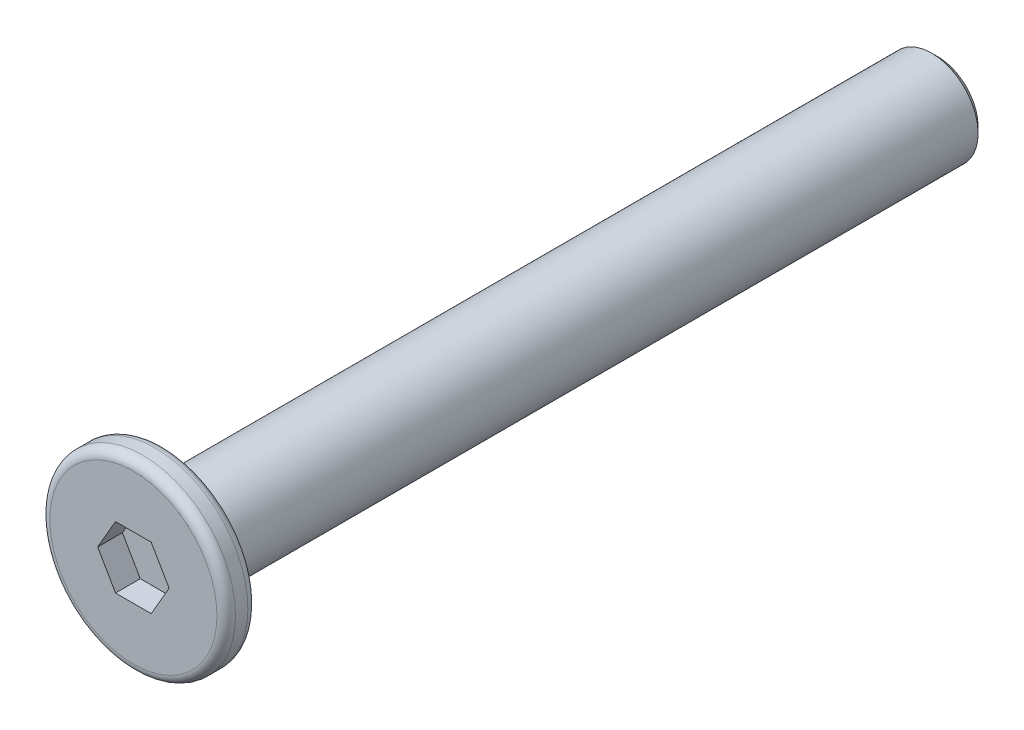
ISO-10303-21;
HEADER;
FILE_DESCRIPTION(('STEP AP214'),'2;1');
FILE_NAME('part.step','',(''),(''),'','','');
FILE_SCHEMA(('AUTOMOTIVE_DESIGN { 1 0 10303 214 1 1 1 1 }'));
ENDSEC;
DATA;
#1=APPLICATION_CONTEXT('core data for automotive mechanical design processes');
#2=APPLICATION_PROTOCOL_DEFINITION('international standard','automotive_design',2000,#1);
#3=PRODUCT_CONTEXT('',#1,'mechanical');
#4=PRODUCT('Part','Part','',(#3));
#5=PRODUCT_RELATED_PRODUCT_CATEGORY('part','',(#4));
#6=PRODUCT_DEFINITION_FORMATION('','',#4);
#7=PRODUCT_DEFINITION_CONTEXT('part definition',#1,'design');
#8=PRODUCT_DEFINITION('design','',#6,#7);
#9=PRODUCT_DEFINITION_SHAPE('','',#8);
#10=(LENGTH_UNIT() NAMED_UNIT(*) SI_UNIT(.MILLI.,.METRE.));
#11=(NAMED_UNIT(*) PLANE_ANGLE_UNIT() SI_UNIT($,.RADIAN.));
#12=(NAMED_UNIT(*) SI_UNIT($,.STERADIAN.) SOLID_ANGLE_UNIT());
#13=UNCERTAINTY_MEASURE_WITH_UNIT(LENGTH_MEASURE(1.E-05),#10,'distance_accuracy_value','');
#14=(GEOMETRIC_REPRESENTATION_CONTEXT(3) GLOBAL_UNCERTAINTY_ASSIGNED_CONTEXT((#13)) GLOBAL_UNIT_ASSIGNED_CONTEXT((#10,
#11,#12)) REPRESENTATION_CONTEXT('',''));
#15=CARTESIAN_POINT('',(0.,0.,0.));
#16=DIRECTION('',(0.,0.,1.));
#17=DIRECTION('',(1.,0.,0.));
#18=AXIS2_PLACEMENT_3D('',#15,#16,#17);
#19=CARTESIAN_POINT('',(0.,0.,0.5));
#20=DIRECTION('',(0.,0.,-1.));
#21=DIRECTION('',(-1.,0.,0.));
#22=AXIS2_PLACEMENT_3D('',#19,#20,#21);
#23=CYLINDRICAL_SURFACE('',#22,3.);
#24=CARTESIAN_POINT('',(0.,0.,-0.2));
#25=DIRECTION('',(0.,0.,1.));
#26=DIRECTION('',(1.,0.,0.));
#27=AXIS2_PLACEMENT_3D('',#24,#25,#26);
#28=CIRCLE('',#27,3.);
#29=CARTESIAN_POINT('',(3.,0.,-0.2));
#30=VERTEX_POINT('',#29);
#31=EDGE_CURVE('E154',#30,#30,#28,.T.);
#32=ORIENTED_EDGE('',*,*,#31,.T.);
#33=EDGE_LOOP('',(#32));
#34=FACE_BOUND('',#33,.T.);
#35=CARTESIAN_POINT('',(0.,0.,0.2));
#36=DIRECTION('',(0.,0.,1.));
#37=DIRECTION('',(1.,0.,0.));
#38=AXIS2_PLACEMENT_3D('',#35,#36,#37);
#39=CIRCLE('',#38,3.);
#40=CARTESIAN_POINT('',(3.,0.,0.2));
#41=VERTEX_POINT('',#40);
#42=EDGE_CURVE('E151',#41,#41,#39,.F.);
#43=ORIENTED_EDGE('',*,*,#42,.T.);
#44=EDGE_LOOP('',(#43));
#45=FACE_BOUND('',#44,.T.);
#46=ADVANCED_FACE('F35',(#34,#45),#23,.T.);
#47=CARTESIAN_POINT('',(0.,0.,0.5));
#48=DIRECTION('',(0.,0.,1.));
#49=DIRECTION('',(1.,0.,0.));
#50=AXIS2_PLACEMENT_3D('',#47,#48,#49);
#51=PLANE('',#50);
#52=CARTESIAN_POINT('',(0.,0.,0.5));
#53=DIRECTION('',(0.,0.,1.));
#54=DIRECTION('',(1.,0.,0.));
#55=AXIS2_PLACEMENT_3D('',#52,#53,#54);
#56=CIRCLE('',#55,2.7);
#57=CARTESIAN_POINT('',(2.7,0.,0.5));
#58=VERTEX_POINT('',#57);
#59=EDGE_CURVE('E11',#58,#58,#56,.T.);
#60=ORIENTED_EDGE('',*,*,#59,.T.);
#61=EDGE_LOOP('',(#60));
#62=FACE_BOUND('',#61,.T.);
#63=DIRECTION('',(0.5,0.866025403784439,0.));
#64=VECTOR('',#63,1.);
#65=CARTESIAN_POINT('',(0.577350269189626,-1.,0.5));
#66=LINE('',#65,#64);
#67=CARTESIAN_POINT('',(0.577350269189626,-1.,0.5));
#68=VERTEX_POINT('',#67);
#69=CARTESIAN_POINT('',(1.15470053837925,0.,0.5));
#70=VERTEX_POINT('',#69);
#71=EDGE_CURVE('E50',#68,#70,#66,.T.);
#72=ORIENTED_EDGE('',*,*,#71,.F.);
#73=DIRECTION('',(1.,0.,0.));
#74=VECTOR('',#73,1.);
#75=CARTESIAN_POINT('',(-0.577350269189625,-1.,0.5));
#76=LINE('',#75,#74);
#77=CARTESIAN_POINT('',(-0.577350269189625,-1.,0.5));
#78=VERTEX_POINT('',#77);
#79=EDGE_CURVE('E133',#78,#68,#76,.T.);
#80=ORIENTED_EDGE('',*,*,#79,.F.);
#81=DIRECTION('',(0.5,-0.866025403784438,0.));
#82=VECTOR('',#81,1.);
#83=CARTESIAN_POINT('',(-1.15470053837925,0.,0.5));
#84=LINE('',#83,#82);
#85=CARTESIAN_POINT('',(-1.15470053837925,0.,0.5));
#86=VERTEX_POINT('',#85);
#87=EDGE_CURVE('E131',#86,#78,#84,.T.);
#88=ORIENTED_EDGE('',*,*,#87,.F.);
#89=DIRECTION('',(-0.5,-0.866025403784438,0.));
#90=VECTOR('',#89,1.);
#91=CARTESIAN_POINT('',(-0.577350269189626,1.,0.5));
#92=LINE('',#91,#90);
#93=CARTESIAN_POINT('',(-0.577350269189626,1.,0.5));
#94=VERTEX_POINT('',#93);
#95=EDGE_CURVE('E98',#94,#86,#92,.T.);
#96=ORIENTED_EDGE('',*,*,#95,.F.);
#97=DIRECTION('',(-1.,0.,0.));
#98=VECTOR('',#97,1.);
#99=CARTESIAN_POINT('',(0.577350269189625,1.,0.5));
#100=LINE('',#99,#98);
#101=CARTESIAN_POINT('',(0.577350269189625,1.,0.5));
#102=VERTEX_POINT('',#101);
#103=EDGE_CURVE('E127',#102,#94,#100,.T.);
#104=ORIENTED_EDGE('',*,*,#103,.F.);
#105=DIRECTION('',(-0.5,0.866025403784438,0.));
#106=VECTOR('',#105,1.);
#107=CARTESIAN_POINT('',(1.15470053837925,0.,0.5));
#108=LINE('',#107,#106);
#109=EDGE_CURVE('E124',#70,#102,#108,.T.);
#110=ORIENTED_EDGE('',*,*,#109,.F.);
#111=EDGE_LOOP('',(#72,#80,#88,#96,#104,#110));
#112=FACE_BOUND('',#111,.T.);
#113=ADVANCED_FACE('F169',(#62,#112),#51,.T.);
#114=CARTESIAN_POINT('',(0.,0.,-0.5));
#115=DIRECTION('',(0.,0.,1.));
#116=DIRECTION('',(1.,0.,0.));
#117=AXIS2_PLACEMENT_3D('',#114,#115,#116);
#118=PLANE('',#117);
#119=CARTESIAN_POINT('',(0.,0.,-0.5));
#120=DIRECTION('',(0.,0.,1.));
#121=DIRECTION('',(1.,0.,0.));
#122=AXIS2_PLACEMENT_3D('',#119,#120,#121);
#123=CIRCLE('',#122,2.7);
#124=CARTESIAN_POINT('',(2.7,0.,-0.5));
#125=VERTEX_POINT('',#124);
#126=EDGE_CURVE('E43',#125,#125,#123,.F.);
#127=ORIENTED_EDGE('',*,*,#126,.T.);
#128=EDGE_LOOP('',(#127));
#129=FACE_BOUND('',#128,.T.);
#130=CARTESIAN_POINT('',(0.,0.,-0.5));
#131=DIRECTION('',(0.,0.,-1.));
#132=DIRECTION('',(-1.,0.,0.));
#133=AXIS2_PLACEMENT_3D('',#130,#131,#132);
#134=CIRCLE('',#133,1.5);
#135=CARTESIAN_POINT('',(-1.5,0.,-0.5));
#136=VERTEX_POINT('',#135);
#137=EDGE_CURVE('E137',#136,#136,#134,.T.);
#138=ORIENTED_EDGE('',*,*,#137,.F.);
#139=EDGE_LOOP('',(#138));
#140=FACE_BOUND('',#139,.T.);
#141=ADVANCED_FACE('F159',(#129,#140),#118,.F.);
#142=CARTESIAN_POINT('',(0.,0.,-25.5));
#143=DIRECTION('',(0.,0.,1.));
#144=DIRECTION('',(1.,0.,0.));
#145=AXIS2_PLACEMENT_3D('',#142,#143,#144);
#146=CYLINDRICAL_SURFACE('',#145,1.5);
#147=CARTESIAN_POINT('',(0.,0.,-25.3));
#148=DIRECTION('',(0.,0.,-1.));
#149=DIRECTION('',(-1.,0.,0.));
#150=AXIS2_PLACEMENT_3D('',#147,#148,#149);
#151=CIRCLE('',#150,1.5);
#152=CARTESIAN_POINT('',(-1.5,0.,-25.3));
#153=VERTEX_POINT('',#152);
#154=EDGE_CURVE('E148',#153,#153,#151,.F.);
#155=ORIENTED_EDGE('',*,*,#154,.T.);
#156=EDGE_LOOP('',(#155));
#157=FACE_BOUND('',#156,.T.);
#158=ORIENTED_EDGE('',*,*,#137,.T.);
#159=EDGE_LOOP('',(#158));
#160=FACE_BOUND('',#159,.T.);
#161=ADVANCED_FACE('F204',(#157,#160),#146,.T.);
#162=CARTESIAN_POINT('',(0.,0.,-25.5));
#163=DIRECTION('',(0.,0.,-1.));
#164=DIRECTION('',(-1.,0.,0.));
#165=AXIS2_PLACEMENT_3D('',#162,#163,#164);
#166=PLANE('',#165);
#167=CARTESIAN_POINT('',(0.,0.,-25.5));
#168=DIRECTION('',(0.,0.,-1.));
#169=DIRECTION('',(-1.,0.,0.));
#170=AXIS2_PLACEMENT_3D('',#167,#168,#169);
#171=CIRCLE('',#170,1.3);
#172=CARTESIAN_POINT('',(-1.3,0.,-25.5));
#173=VERTEX_POINT('',#172);
#174=EDGE_CURVE('E145',#173,#173,#171,.T.);
#175=ORIENTED_EDGE('',*,*,#174,.T.);
#176=EDGE_LOOP('',(#175));
#177=FACE_BOUND('',#176,.T.);
#178=ADVANCED_FACE('F196',(#177),#166,.T.);
#179=CARTESIAN_POINT('',(0.,0.,-25.5));
#180=DIRECTION('',(0.,0.,1.));
#181=DIRECTION('',(1.,0.,0.));
#182=AXIS2_PLACEMENT_3D('',#179,#180,#181);
#183=CONICAL_SURFACE('',#182,1.3,0.785398163397446);
#184=ORIENTED_EDGE('',*,*,#154,.F.);
#185=EDGE_LOOP('',(#184));
#186=FACE_BOUND('',#185,.T.);
#187=ORIENTED_EDGE('',*,*,#174,.F.);
#188=EDGE_LOOP('',(#187));
#189=FACE_BOUND('',#188,.T.);
#190=ADVANCED_FACE('F189',(#186,#189),#183,.T.);
#191=CARTESIAN_POINT('',(0.577350269189626,-1.,-0.3));
#192=DIRECTION('',(0.866025403784439,-0.5,0.));
#193=DIRECTION('',(0.5,0.866025403784439,0.));
#194=AXIS2_PLACEMENT_3D('',#191,#192,#193);
#195=PLANE('',#194);
#196=ORIENTED_EDGE('',*,*,#71,.T.);
#197=DIRECTION('',(0.,0.,1.));
#198=VECTOR('',#197,1.);
#199=CARTESIAN_POINT('',(1.15470053837925,0.,-0.3));
#200=LINE('',#199,#198);
#201=CARTESIAN_POINT('',(1.15470053837925,0.,-0.3));
#202=VERTEX_POINT('',#201);
#203=EDGE_CURVE('E80',#202,#70,#200,.T.);
#204=ORIENTED_EDGE('',*,*,#203,.F.);
#205=DIRECTION('',(0.5,0.866025403784439,0.));
#206=VECTOR('',#205,1.);
#207=CARTESIAN_POINT('',(0.577350269189626,-1.,-0.3));
#208=LINE('',#207,#206);
#209=CARTESIAN_POINT('',(0.577350269189626,-1.,-0.3));
#210=VERTEX_POINT('',#209);
#211=EDGE_CURVE('E135',#210,#202,#208,.T.);
#212=ORIENTED_EDGE('',*,*,#211,.F.);
#213=DIRECTION('',(0.,0.,1.));
#214=VECTOR('',#213,1.);
#215=CARTESIAN_POINT('',(0.577350269189626,-1.,-0.3));
#216=LINE('',#215,#214);
#217=EDGE_CURVE('E58',#210,#68,#216,.T.);
#218=ORIENTED_EDGE('',*,*,#217,.T.);
#219=EDGE_LOOP('',(#196,#204,#212,#218));
#220=FACE_BOUND('',#219,.T.);
#221=ADVANCED_FACE('F186',(#220),#195,.F.);
#222=CARTESIAN_POINT('',(-0.577350269189625,-1.,-0.3));
#223=DIRECTION('',(0.,-1.,0.));
#224=DIRECTION('',(1.,0.,0.));
#225=AXIS2_PLACEMENT_3D('',#222,#223,#224);
#226=PLANE('',#225);
#227=ORIENTED_EDGE('',*,*,#79,.T.);
#228=ORIENTED_EDGE('',*,*,#217,.F.);
#229=DIRECTION('',(1.,0.,0.));
#230=VECTOR('',#229,1.);
#231=CARTESIAN_POINT('',(-0.577350269189625,-1.,-0.3));
#232=LINE('',#231,#230);
#233=CARTESIAN_POINT('',(-0.577350269189625,-1.,-0.3));
#234=VERTEX_POINT('',#233);
#235=EDGE_CURVE('E110',#234,#210,#232,.T.);
#236=ORIENTED_EDGE('',*,*,#235,.F.);
#237=DIRECTION('',(0.,0.,1.));
#238=VECTOR('',#237,1.);
#239=CARTESIAN_POINT('',(-0.577350269189625,-1.,-0.3));
#240=LINE('',#239,#238);
#241=EDGE_CURVE('E102',#234,#78,#240,.T.);
#242=ORIENTED_EDGE('',*,*,#241,.T.);
#243=EDGE_LOOP('',(#227,#228,#236,#242));
#244=FACE_BOUND('',#243,.T.);
#245=ADVANCED_FACE('F188',(#244),#226,.F.);
#246=CARTESIAN_POINT('',(-1.15470053837925,0.,-0.3));
#247=DIRECTION('',(-0.866025403784438,-0.5,0.));
#248=DIRECTION('',(0.5,-0.866025403784438,0.));
#249=AXIS2_PLACEMENT_3D('',#246,#247,#248);
#250=PLANE('',#249);
#251=ORIENTED_EDGE('',*,*,#87,.T.);
#252=ORIENTED_EDGE('',*,*,#241,.F.);
#253=DIRECTION('',(0.5,-0.866025403784438,0.));
#254=VECTOR('',#253,1.);
#255=CARTESIAN_POINT('',(-1.15470053837925,0.,-0.3));
#256=LINE('',#255,#254);
#257=CARTESIAN_POINT('',(-1.15470053837925,0.,-0.3));
#258=VERTEX_POINT('',#257);
#259=EDGE_CURVE('E106',#258,#234,#256,.T.);
#260=ORIENTED_EDGE('',*,*,#259,.F.);
#261=DIRECTION('',(0.,0.,1.));
#262=VECTOR('',#261,1.);
#263=CARTESIAN_POINT('',(-1.15470053837925,0.,-0.3));
#264=LINE('',#263,#262);
#265=EDGE_CURVE('E91',#258,#86,#264,.T.);
#266=ORIENTED_EDGE('',*,*,#265,.T.);
#267=EDGE_LOOP('',(#251,#252,#260,#266));
#268=FACE_BOUND('',#267,.T.);
#269=ADVANCED_FACE('F107',(#268),#250,.F.);
#270=CARTESIAN_POINT('',(-0.577350269189626,1.,-0.3));
#271=DIRECTION('',(-0.866025403784438,0.5,0.));
#272=DIRECTION('',(-0.5,-0.866025403784439,0.));
#273=AXIS2_PLACEMENT_3D('',#270,#271,#272);
#274=PLANE('',#273);
#275=ORIENTED_EDGE('',*,*,#95,.T.);
#276=ORIENTED_EDGE('',*,*,#265,.F.);
#277=DIRECTION('',(-0.5,-0.866025403784438,0.));
#278=VECTOR('',#277,1.);
#279=CARTESIAN_POINT('',(-0.577350269189626,1.,-0.3));
#280=LINE('',#279,#278);
#281=CARTESIAN_POINT('',(-0.577350269189626,1.,-0.3));
#282=VERTEX_POINT('',#281);
#283=EDGE_CURVE('E95',#282,#258,#280,.T.);
#284=ORIENTED_EDGE('',*,*,#283,.F.);
#285=DIRECTION('',(0.,0.,1.));
#286=VECTOR('',#285,1.);
#287=CARTESIAN_POINT('',(-0.577350269189626,1.,-0.3));
#288=LINE('',#287,#286);
#289=EDGE_CURVE('E103',#282,#94,#288,.T.);
#290=ORIENTED_EDGE('',*,*,#289,.T.);
#291=EDGE_LOOP('',(#275,#276,#284,#290));
#292=FACE_BOUND('',#291,.T.);
#293=ADVANCED_FACE('F93',(#292),#274,.F.);
#294=CARTESIAN_POINT('',(0.577350269189625,1.,-0.3));
#295=DIRECTION('',(0.,1.,0.));
#296=DIRECTION('',(0.,0.,1.));
#297=AXIS2_PLACEMENT_3D('',#294,#295,#296);
#298=PLANE('',#297);
#299=ORIENTED_EDGE('',*,*,#103,.T.);
#300=ORIENTED_EDGE('',*,*,#289,.F.);
#301=DIRECTION('',(-1.,0.,0.));
#302=VECTOR('',#301,1.);
#303=CARTESIAN_POINT('',(0.577350269189625,1.,-0.3));
#304=LINE('',#303,#302);
#305=CARTESIAN_POINT('',(0.577350269189625,1.,-0.3));
#306=VERTEX_POINT('',#305);
#307=EDGE_CURVE('E116',#306,#282,#304,.T.);
#308=ORIENTED_EDGE('',*,*,#307,.F.);
#309=DIRECTION('',(0.,0.,1.));
#310=VECTOR('',#309,1.);
#311=CARTESIAN_POINT('',(0.577350269189625,1.,-0.3));
#312=LINE('',#311,#310);
#313=EDGE_CURVE('E140',#306,#102,#312,.T.);
#314=ORIENTED_EDGE('',*,*,#313,.T.);
#315=EDGE_LOOP('',(#299,#300,#308,#314));
#316=FACE_BOUND('',#315,.T.);
#317=ADVANCED_FACE('F257',(#316),#298,.F.);
#318=CARTESIAN_POINT('',(1.15470053837925,0.,-0.3));
#319=DIRECTION('',(0.866025403784438,0.5,0.));
#320=DIRECTION('',(-0.5,0.866025403784439,0.));
#321=AXIS2_PLACEMENT_3D('',#318,#319,#320);
#322=PLANE('',#321);
#323=ORIENTED_EDGE('',*,*,#109,.T.);
#324=ORIENTED_EDGE('',*,*,#313,.F.);
#325=DIRECTION('',(-0.5,0.866025403784438,0.));
#326=VECTOR('',#325,1.);
#327=CARTESIAN_POINT('',(1.15470053837925,0.,-0.3));
#328=LINE('',#327,#326);
#329=EDGE_CURVE('E118',#202,#306,#328,.T.);
#330=ORIENTED_EDGE('',*,*,#329,.F.);
#331=ORIENTED_EDGE('',*,*,#203,.T.);
#332=EDGE_LOOP('',(#323,#324,#330,#331));
#333=FACE_BOUND('',#332,.T.);
#334=ADVANCED_FACE('F184',(#333),#322,.F.);
#335=CARTESIAN_POINT('',(0.,0.,-0.3));
#336=DIRECTION('',(0.,0.,1.));
#337=DIRECTION('',(1.,0.,0.));
#338=AXIS2_PLACEMENT_3D('',#335,#336,#337);
#339=PLANE('',#338);
#340=ORIENTED_EDGE('',*,*,#211,.T.);
#341=ORIENTED_EDGE('',*,*,#329,.T.);
#342=ORIENTED_EDGE('',*,*,#307,.T.);
#343=ORIENTED_EDGE('',*,*,#283,.T.);
#344=ORIENTED_EDGE('',*,*,#259,.T.);
#345=ORIENTED_EDGE('',*,*,#235,.T.);
#346=EDGE_LOOP('',(#340,#341,#342,#343,#344,#345));
#347=FACE_BOUND('',#346,.T.);
#348=ADVANCED_FACE('F113',(#347),#339,.T.);
#349=CARTESIAN_POINT('',(0.,0.,-0.2));
#350=DIRECTION('',(0.,0.,1.));
#351=DIRECTION('',(1.,0.,0.));
#352=AXIS2_PLACEMENT_3D('',#349,#350,#351);
#353=TOROIDAL_SURFACE('',#352,2.7,0.3);
#354=ORIENTED_EDGE('',*,*,#126,.F.);
#355=EDGE_LOOP('',(#354));
#356=FACE_BOUND('',#355,.T.);
#357=ORIENTED_EDGE('',*,*,#31,.F.);
#358=EDGE_LOOP('',(#357));
#359=FACE_BOUND('',#358,.T.);
#360=ADVANCED_FACE('F162',(#356,#359),#353,.T.);
#361=CARTESIAN_POINT('',(0.,0.,0.2));
#362=DIRECTION('',(0.,0.,1.));
#363=DIRECTION('',(1.,0.,0.));
#364=AXIS2_PLACEMENT_3D('',#361,#362,#363);
#365=TOROIDAL_SURFACE('',#364,2.7,0.3);
#366=ORIENTED_EDGE('',*,*,#42,.F.);
#367=EDGE_LOOP('',(#366));
#368=FACE_BOUND('',#367,.T.);
#369=ORIENTED_EDGE('',*,*,#59,.F.);
#370=EDGE_LOOP('',(#369));
#371=FACE_BOUND('',#370,.T.);
#372=ADVANCED_FACE('F37',(#368,#371),#365,.T.);
#373=CLOSED_SHELL('',(#46,#113,#141,#161,#178,#190,#221,#245,#269,#293,#317,#334,#348,#360,#372));
#374=MANIFOLD_SOLID_BREP('B2',#373);
#375=ADVANCED_BREP_SHAPE_REPRESENTATION('',(#18,#374),#14);
#376=SHAPE_DEFINITION_REPRESENTATION(#9,#375);
ENDSEC;
END-ISO-10303-21;
